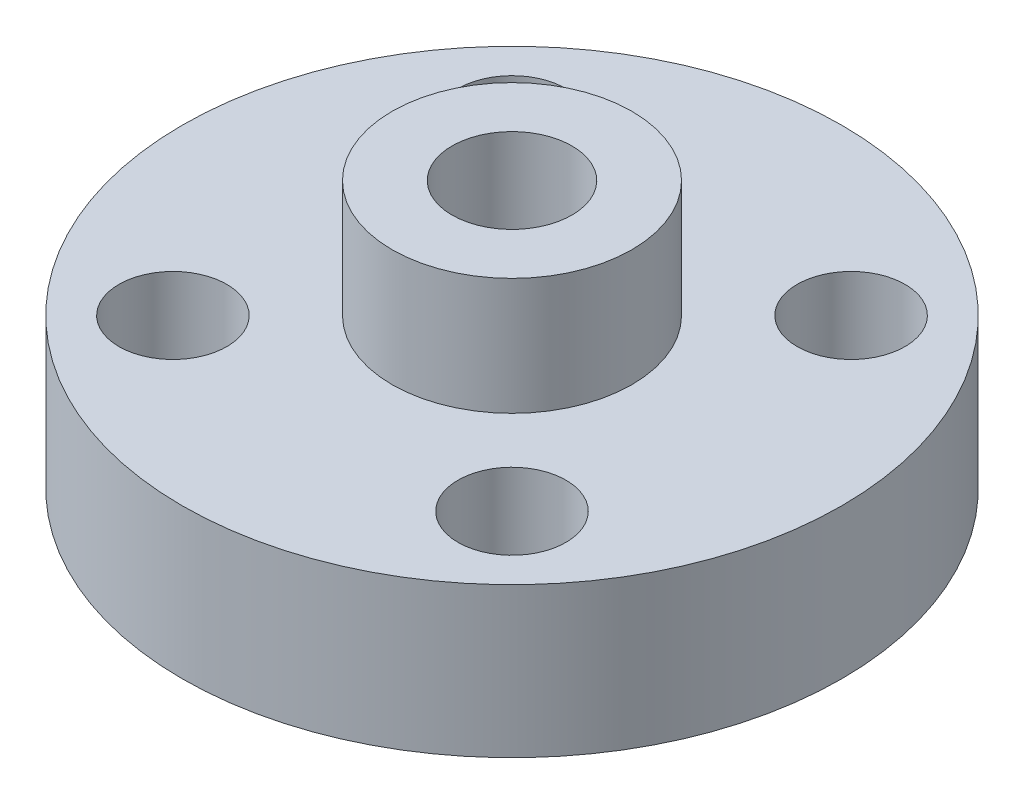
ISO-10303-21;
HEADER;
FILE_DESCRIPTION(('STEP AP214'),'2;1');
FILE_NAME('part.step','',(''),(''),'','','');
FILE_SCHEMA(('AUTOMOTIVE_DESIGN { 1 0 10303 214 1 1 1 1 }'));
ENDSEC;
DATA;
#1=APPLICATION_CONTEXT('core data for automotive mechanical design processes');
#2=APPLICATION_PROTOCOL_DEFINITION('international standard','automotive_design',2000,#1);
#3=PRODUCT_CONTEXT('',#1,'mechanical');
#4=PRODUCT('Part','Part','',(#3));
#5=PRODUCT_RELATED_PRODUCT_CATEGORY('part','',(#4));
#6=PRODUCT_DEFINITION_FORMATION('','',#4);
#7=PRODUCT_DEFINITION_CONTEXT('part definition',#1,'design');
#8=PRODUCT_DEFINITION('design','',#6,#7);
#9=PRODUCT_DEFINITION_SHAPE('','',#8);
#10=(LENGTH_UNIT() NAMED_UNIT(*) SI_UNIT(.MILLI.,.METRE.));
#11=(NAMED_UNIT(*) PLANE_ANGLE_UNIT() SI_UNIT($,.RADIAN.));
#12=(NAMED_UNIT(*) SI_UNIT($,.STERADIAN.) SOLID_ANGLE_UNIT());
#13=UNCERTAINTY_MEASURE_WITH_UNIT(LENGTH_MEASURE(1.E-05),#10,'distance_accuracy_value','');
#14=(GEOMETRIC_REPRESENTATION_CONTEXT(3) GLOBAL_UNCERTAINTY_ASSIGNED_CONTEXT((#13)) GLOBAL_UNIT_ASSIGNED_CONTEXT((#10,
#11,#12)) REPRESENTATION_CONTEXT('',''));
#15=CARTESIAN_POINT('',(0.,0.,0.));
#16=DIRECTION('',(0.,0.,1.));
#17=DIRECTION('',(1.,0.,0.));
#18=AXIS2_PLACEMENT_3D('',#15,#16,#17);
#19=CARTESIAN_POINT('',(0.,5.,0.));
#20=DIRECTION('',(0.,1.,0.));
#21=DIRECTION('',(0.,0.,1.));
#22=AXIS2_PLACEMENT_3D('',#19,#20,#21);
#23=PLANE('',#22);
#24=CARTESIAN_POINT('',(5.65685424949229,5.,5.65685424949247));
#25=DIRECTION('',(0.,1.,0.));
#26=DIRECTION('',(0.,0.,1.));
#27=AXIS2_PLACEMENT_3D('',#24,#25,#26);
#28=CIRCLE('',#27,1.8);
#29=CARTESIAN_POINT('',(5.65685424949229,5.,7.45685424949247));
#30=VERTEX_POINT('',#29);
#31=EDGE_CURVE('E77',#30,#30,#28,.T.);
#32=ORIENTED_EDGE('',*,*,#31,.F.);
#33=EDGE_LOOP('',(#32));
#34=FACE_BOUND('',#33,.T.);
#35=CARTESIAN_POINT('',(-5.65685424949229,5.,-5.65685424949247));
#36=DIRECTION('',(0.,1.,0.));
#37=DIRECTION('',(0.,0.,1.));
#38=AXIS2_PLACEMENT_3D('',#35,#36,#37);
#39=CIRCLE('',#38,1.8);
#40=CARTESIAN_POINT('',(-5.65685424949229,5.,-3.85685424949247));
#41=VERTEX_POINT('',#40);
#42=EDGE_CURVE('E71',#41,#41,#39,.T.);
#43=ORIENTED_EDGE('',*,*,#42,.F.);
#44=EDGE_LOOP('',(#43));
#45=FACE_BOUND('',#44,.T.);
#46=CARTESIAN_POINT('',(-5.65685424949237,5.,5.65685424949239));
#47=DIRECTION('',(0.,1.,0.));
#48=DIRECTION('',(0.,0.,1.));
#49=AXIS2_PLACEMENT_3D('',#46,#47,#48);
#50=CIRCLE('',#49,1.8);
#51=CARTESIAN_POINT('',(-5.65685424949237,5.,7.45685424949239));
#52=VERTEX_POINT('',#51);
#53=EDGE_CURVE('E65',#52,#52,#50,.T.);
#54=ORIENTED_EDGE('',*,*,#53,.F.);
#55=EDGE_LOOP('',(#54));
#56=FACE_BOUND('',#55,.T.);
#57=CARTESIAN_POINT('',(5.65685424949237,5.,-5.65685424949239));
#58=DIRECTION('',(0.,1.,0.));
#59=DIRECTION('',(0.,0.,1.));
#60=AXIS2_PLACEMENT_3D('',#57,#58,#59);
#61=CIRCLE('',#60,1.8);
#62=CARTESIAN_POINT('',(5.65685424949237,5.,-3.85685424949239));
#63=VERTEX_POINT('',#62);
#64=EDGE_CURVE('E59',#63,#63,#61,.T.);
#65=ORIENTED_EDGE('',*,*,#64,.F.);
#66=EDGE_LOOP('',(#65));
#67=FACE_BOUND('',#66,.T.);
#68=CARTESIAN_POINT('',(0.,5.,0.));
#69=DIRECTION('',(0.,1.,0.));
#70=DIRECTION('',(0.,0.,1.));
#71=AXIS2_PLACEMENT_3D('',#68,#69,#70);
#72=CIRCLE('',#71,11.);
#73=CARTESIAN_POINT('',(0.,5.,11.));
#74=VERTEX_POINT('',#73);
#75=EDGE_CURVE('E10',#74,#74,#72,.T.);
#76=ORIENTED_EDGE('',*,*,#75,.T.);
#77=EDGE_LOOP('',(#76));
#78=FACE_BOUND('',#77,.T.);
#79=CARTESIAN_POINT('',(0.,5.,0.));
#80=DIRECTION('',(0.,1.,0.));
#81=DIRECTION('',(0.,0.,1.));
#82=AXIS2_PLACEMENT_3D('',#79,#80,#81);
#83=CIRCLE('',#82,4.);
#84=CARTESIAN_POINT('',(0.,5.,4.));
#85=VERTEX_POINT('',#84);
#86=EDGE_CURVE('E53',#85,#85,#83,.T.);
#87=ORIENTED_EDGE('',*,*,#86,.F.);
#88=EDGE_LOOP('',(#87));
#89=FACE_BOUND('',#88,.T.);
#90=ADVANCED_FACE('F33',(#34,#45,#56,#67,#78,#89),#23,.T.);
#91=CARTESIAN_POINT('',(0.,5.,0.));
#92=DIRECTION('',(0.,-1.,0.));
#93=DIRECTION('',(0.,0.,-1.));
#94=AXIS2_PLACEMENT_3D('',#91,#92,#93);
#95=CYLINDRICAL_SURFACE('',#94,11.);
#96=CARTESIAN_POINT('',(0.,3.75,-11.));
#97=CARTESIAN_POINT('',(-0.069971060246352,3.74999699818814,-10.999999098796));
#98=CARTESIAN_POINT('',(-0.139987069063114,3.74410506509641,-10.9993252987046));
#99=CARTESIAN_POINT('',(-0.27807424350527,3.7206920371657,-10.996702178266));
#100=CARTESIAN_POINT('',(-0.346143242753095,3.7031584768452,-10.9947514907003));
#101=CARTESIAN_POINT('',(-0.478317045301572,3.65698245914168,-10.9897945640633));
#102=CARTESIAN_POINT('',(-0.542424355017518,3.62834711062706,-10.9867890005829));
#103=CARTESIAN_POINT('',(-0.664910051163533,3.56079510299002,-10.9800574647103));
#104=CARTESIAN_POINT('',(-0.723289492682512,3.52188034225789,-10.9763316253718));
#105=CARTESIAN_POINT('',(-0.832943192201771,3.43468294825341,-10.968557071608));
#106=CARTESIAN_POINT('',(-0.884187415913993,3.38636265432368,-10.9645070990459));
#107=CARTESIAN_POINT('',(-0.9778576114592,3.28180649659008,-10.9565510031881));
#108=CARTESIAN_POINT('',(-1.0202831544839,3.22557024809588,-10.9526448868951));
#109=CARTESIAN_POINT('',(-1.09522113283393,3.10658651677425,-10.9454062056308));
#110=CARTESIAN_POINT('',(-1.12770585724159,3.04382147448482,-10.9420752550327));
#111=CARTESIAN_POINT('',(-1.18166312999782,2.91368303245055,-10.9363802408844));
#112=CARTESIAN_POINT('',(-1.20313602534931,2.84630977799478,-10.9340161468672));
#113=CARTESIAN_POINT('',(-1.23436981435034,2.70917683280815,-10.9305342775891));
#114=CARTESIAN_POINT('',(-1.24418104088519,2.63942874432143,-10.9294111476981));
#115=CARTESIAN_POINT('',(-1.25196865940665,2.49926759216056,-10.928521890078));
#116=CARTESIAN_POINT('',(-1.24994544765987,2.42885455083064,-10.9287557169125));
#117=CARTESIAN_POINT('',(-1.23416301698983,2.2897111909642,-10.9305490559729));
#118=CARTESIAN_POINT('',(-1.22045900541516,2.22097451875746,-10.9321023319257));
#119=CARTESIAN_POINT('',(-1.18179000539199,2.08678297309618,-10.9363498240334));
#120=CARTESIAN_POINT('',(-1.15682482519952,2.02132815554287,-10.9390440596154));
#121=CARTESIAN_POINT('',(-1.09628205008229,1.89538543961468,-10.9452770263127));
#122=CARTESIAN_POINT('',(-1.0606802226634,1.83490928933373,-10.9488176820281));
#123=CARTESIAN_POINT('',(-0.97989212909765,1.72076925155199,-10.9563429994385));
#124=CARTESIAN_POINT('',(-0.934705500466707,1.66710562181413,-10.9603276779232));
#125=CARTESIAN_POINT('',(-0.83572337613361,1.56779331897667,-10.9683198318057));
#126=CARTESIAN_POINT('',(-0.781880249551105,1.52219210498768,-10.9723273076041));
#127=CARTESIAN_POINT('',(-0.667278205581041,1.44066779872062,-10.9798921650149));
#128=CARTESIAN_POINT('',(-0.606519276591015,1.40474472267966,-10.9834495458722));
#129=CARTESIAN_POINT('',(-0.479775541657342,1.34359731749806,-10.9897150774974));
#130=CARTESIAN_POINT('',(-0.413789421907936,1.318375688256,-10.9924230139116));
#131=CARTESIAN_POINT('',(-0.278481205096859,1.27938340396215,-10.9966825017733));
#132=CARTESIAN_POINT('',(-0.209159237088376,1.26561230630247,-10.9982340979176));
#133=CARTESIAN_POINT('',(-0.0695577812372831,1.24997287847912,-11.0000003081264));
#134=CARTESIAN_POINT('',(0.000714287189984298,1.24803911714425,-11.0002222716223));
#135=CARTESIAN_POINT('',(0.140581487877393,1.25595697581694,-10.9993239851522));
#136=CARTESIAN_POINT('',(0.210176631981749,1.26580838924277,-10.9982037587135));
#137=CARTESIAN_POINT('',(0.346523396585519,1.29696262846704,-10.994751592849));
#138=CARTESIAN_POINT('',(0.413282173840756,1.31823452614039,-10.9924229265985));
#139=CARTESIAN_POINT('',(0.542284372808938,1.37159392721105,-10.9868148348929));
#140=CARTESIAN_POINT('',(0.604527665792278,1.40368173880652,-10.9835353823457));
#141=CARTESIAN_POINT('',(0.72302600604694,1.47792232596807,-10.9763735736619));
#142=CARTESIAN_POINT('',(0.77925417992158,1.52011774715062,-10.9724886880503));
#143=CARTESIAN_POINT('',(0.883853426159775,1.61331505860913,-10.9645592695384));
#144=CARTESIAN_POINT('',(0.932224242281437,1.66431723597664,-10.9605147314369));
#145=CARTESIAN_POINT('',(1.01996547066726,1.77396722356543,-10.9526994422005));
#146=CARTESIAN_POINT('',(1.05929271449872,1.83264968850057,-10.9489300605485));
#147=CARTESIAN_POINT('',(1.12753292733449,1.95582498686534,-10.942113624429));
#148=CARTESIAN_POINT('',(1.1564460738557,2.0203177212307,-10.9390665576492));
#149=CARTESIAN_POINT('',(1.20296631338929,2.15313935058659,-10.9340487479586));
#150=CARTESIAN_POINT('',(1.22059839191765,2.22145940091596,-10.9320756279092));
#151=CARTESIAN_POINT('',(1.24413675347569,2.36011418608627,-10.9294220488897));
#152=CARTESIAN_POINT('',(1.25004348037983,2.43044884456001,-10.9287415409866));
#153=CARTESIAN_POINT('',(1.24995628412517,2.57070705786577,-10.9287514804399));
#154=CARTESIAN_POINT('',(1.2440301726015,2.64063066519323,-10.9294341158956));
#155=CARTESIAN_POINT('',(1.22058843708507,2.77848162141657,-10.9320766991578));
#156=CARTESIAN_POINT('',(1.20307280564944,2.84640896903041,-10.9340366477846));
#157=CARTESIAN_POINT('',(1.15696926667395,2.9783342740526,-10.9390107260672));
#158=CARTESIAN_POINT('',(1.12838402190138,3.0423331721536,-10.9420246021864));
#159=CARTESIAN_POINT('',(1.06095945000961,3.16463624005349,-10.9487674156768));
#160=CARTESIAN_POINT('',(1.0221200832636,3.22294038784396,-10.9524963558113));
#161=CARTESIAN_POINT('',(0.935036488100244,3.33254612900023,-10.9602747641055));
#162=CARTESIAN_POINT('',(0.886741677283601,3.3838074186029,-10.96432588332));
#163=CARTESIAN_POINT('',(0.782221793226736,3.47752568809066,-10.972277338952));
#164=CARTESIAN_POINT('',(0.725994839471986,3.51998057428255,-10.9761776393339));
#165=CARTESIAN_POINT('',(0.607005915440281,3.59499201372946,-10.9834013412845));
#166=CARTESIAN_POINT('',(0.54422378573775,3.62751674875123,-10.9867228740683));
#167=CARTESIAN_POINT('',(0.414088724760015,3.68151706433772,-10.9923953332668));
#168=CARTESIAN_POINT('',(0.346740944451992,3.70300486944508,-10.9947473329669));
#169=CARTESIAN_POINT('',(0.232523699684409,3.7290739614261,-10.9976371163841));
#170=CARTESIAN_POINT('',(0.18637950484338,3.73691021850484,-10.9985189706332));
#171=CARTESIAN_POINT('',(0.0934968952111788,3.74737422589619,-10.9997007118951));
#172=CARTESIAN_POINT('',(0.0467584838174206,3.75000200597462,-11.0000006022337));
#173=CARTESIAN_POINT('',(0.,3.75,-11.));
#174=B_SPLINE_CURVE_WITH_KNOTS('',3,(#96,#97,#98,#99,#100,#101,#102,#103,#104,#105,#106,#107,
#108,#109,#110,#111,#112,#113,#114,#115,#116,#117,#118,#119,#120,#121,#122,#123,#124,#125,#126,
#127,#128,#129,#130,#131,#132,#133,#134,#135,#136,#137,#138,#139,#140,#141,#142,#143,#144,#145,
#146,#147,#148,#149,#150,#151,#152,#153,#154,#155,#156,#157,#158,#159,#160,#161,#162,#163,#164,
#165,#166,#167,#168,#169,#170,#171,#172,#173),.UNSPECIFIED.,.T.,.F.,(4,2,2,2,2,2,2,2,2,2,2,2,2,
2,2,2,2,2,2,2,2,2,2,2,2,2,2,2,2,2,2,2,2,2,2,2,2,2,4),(0.,0.209742411074567,0.419709770574088,
0.629542902006037,0.839337308750923,1.04998970573655,1.26065234329855,1.47189698188367,
1.68313496335365,1.89345787180112,2.10377373779623,2.31310105799441,2.52243194254448,
2.73224341085967,2.94206281537296,3.15307892807649,3.36409539480162,3.57516506786321,
3.78622658187585,3.99612038686368,4.20601051268755,4.41533507552064,4.62466560353621,
4.83489538837651,5.04513202779438,5.25635228791534,5.4675689474421,5.67831616606274,
5.88905540649307,6.09859040856626,6.30812554520447,6.51761030997687,6.72709588430993,
6.9377343421937,7.14842282141904,7.35977947100788,7.57090151365798,7.71106364850652,
7.85122498234265),.UNSPECIFIED.);
#175=CARTESIAN_POINT('',(0.,3.75,-11.));
#176=VERTEX_POINT('',#175);
#177=EDGE_CURVE('E86',#176,#176,#174,.T.);
#178=ORIENTED_EDGE('',*,*,#177,.T.);
#179=EDGE_LOOP('',(#178));
#180=FACE_BOUND('',#179,.T.);
#181=ORIENTED_EDGE('',*,*,#75,.F.);
#182=EDGE_LOOP('',(#181));
#183=FACE_BOUND('',#182,.T.);
#184=CARTESIAN_POINT('',(0.,0.,0.));
#185=DIRECTION('',(0.,1.,0.));
#186=DIRECTION('',(0.,0.,1.));
#187=AXIS2_PLACEMENT_3D('',#184,#185,#186);
#188=CIRCLE('',#187,11.);
#189=CARTESIAN_POINT('',(0.,0.,11.));
#190=VERTEX_POINT('',#189);
#191=EDGE_CURVE('E46',#190,#190,#188,.T.);
#192=ORIENTED_EDGE('',*,*,#191,.T.);
#193=EDGE_LOOP('',(#192));
#194=FACE_BOUND('',#193,.T.);
#195=ADVANCED_FACE('F35',(#180,#183,#194),#95,.T.);
#196=CARTESIAN_POINT('',(0.,0.,0.));
#197=DIRECTION('',(0.,1.,0.));
#198=DIRECTION('',(0.,0.,1.));
#199=AXIS2_PLACEMENT_3D('',#196,#197,#198);
#200=PLANE('',#199);
#201=CARTESIAN_POINT('',(0.,0.,0.));
#202=DIRECTION('',(0.,1.,0.));
#203=DIRECTION('',(0.,0.,1.));
#204=AXIS2_PLACEMENT_3D('',#201,#202,#203);
#205=CIRCLE('',#204,2.);
#206=CARTESIAN_POINT('',(0.,0.,2.));
#207=VERTEX_POINT('',#206);
#208=EDGE_CURVE('E80',#207,#207,#205,.T.);
#209=ORIENTED_EDGE('',*,*,#208,.T.);
#210=EDGE_LOOP('',(#209));
#211=FACE_BOUND('',#210,.T.);
#212=CARTESIAN_POINT('',(5.65685424949229,0.,5.65685424949247));
#213=DIRECTION('',(0.,1.,0.));
#214=DIRECTION('',(0.,0.,1.));
#215=AXIS2_PLACEMENT_3D('',#212,#213,#214);
#216=CIRCLE('',#215,1.8);
#217=CARTESIAN_POINT('',(5.65685424949229,0.,7.45685424949247));
#218=VERTEX_POINT('',#217);
#219=EDGE_CURVE('E74',#218,#218,#216,.T.);
#220=ORIENTED_EDGE('',*,*,#219,.T.);
#221=EDGE_LOOP('',(#220));
#222=FACE_BOUND('',#221,.T.);
#223=CARTESIAN_POINT('',(-5.65685424949229,0.,-5.65685424949247));
#224=DIRECTION('',(0.,1.,0.));
#225=DIRECTION('',(0.,0.,1.));
#226=AXIS2_PLACEMENT_3D('',#223,#224,#225);
#227=CIRCLE('',#226,1.8);
#228=CARTESIAN_POINT('',(-5.65685424949229,0.,-3.85685424949247));
#229=VERTEX_POINT('',#228);
#230=EDGE_CURVE('E68',#229,#229,#227,.T.);
#231=ORIENTED_EDGE('',*,*,#230,.T.);
#232=EDGE_LOOP('',(#231));
#233=FACE_BOUND('',#232,.T.);
#234=CARTESIAN_POINT('',(-5.65685424949237,0.,5.65685424949239));
#235=DIRECTION('',(0.,1.,0.));
#236=DIRECTION('',(0.,0.,1.));
#237=AXIS2_PLACEMENT_3D('',#234,#235,#236);
#238=CIRCLE('',#237,1.8);
#239=CARTESIAN_POINT('',(-5.65685424949237,0.,7.45685424949239));
#240=VERTEX_POINT('',#239);
#241=EDGE_CURVE('E62',#240,#240,#238,.T.);
#242=ORIENTED_EDGE('',*,*,#241,.T.);
#243=EDGE_LOOP('',(#242));
#244=FACE_BOUND('',#243,.T.);
#245=CARTESIAN_POINT('',(5.65685424949237,0.,-5.65685424949239));
#246=DIRECTION('',(0.,1.,0.));
#247=DIRECTION('',(0.,0.,1.));
#248=AXIS2_PLACEMENT_3D('',#245,#246,#247);
#249=CIRCLE('',#248,1.8);
#250=CARTESIAN_POINT('',(5.65685424949237,0.,-3.85685424949239));
#251=VERTEX_POINT('',#250);
#252=EDGE_CURVE('E56',#251,#251,#249,.T.);
#253=ORIENTED_EDGE('',*,*,#252,.T.);
#254=EDGE_LOOP('',(#253));
#255=FACE_BOUND('',#254,.T.);
#256=ORIENTED_EDGE('',*,*,#191,.F.);
#257=EDGE_LOOP('',(#256));
#258=FACE_BOUND('',#257,.T.);
#259=ADVANCED_FACE('F125',(#211,#222,#233,#244,#255,#258),#200,.F.);
#260=CARTESIAN_POINT('',(0.,8.9,0.));
#261=DIRECTION('',(0.,-1.,0.));
#262=DIRECTION('',(0.,0.,-1.));
#263=AXIS2_PLACEMENT_3D('',#260,#261,#262);
#264=CYLINDRICAL_SURFACE('',#263,4.);
#265=CARTESIAN_POINT('',(0.,8.9,0.));
#266=DIRECTION('',(0.,1.,0.));
#267=DIRECTION('',(0.,0.,1.));
#268=AXIS2_PLACEMENT_3D('',#265,#266,#267);
#269=CIRCLE('',#268,4.);
#270=CARTESIAN_POINT('',(0.,8.9,4.));
#271=VERTEX_POINT('',#270);
#272=EDGE_CURVE('E51',#271,#271,#269,.T.);
#273=ORIENTED_EDGE('',*,*,#272,.F.);
#274=EDGE_LOOP('',(#273));
#275=FACE_BOUND('',#274,.T.);
#276=ORIENTED_EDGE('',*,*,#86,.T.);
#277=EDGE_LOOP('',(#276));
#278=FACE_BOUND('',#277,.T.);
#279=ADVANCED_FACE('F121',(#275,#278),#264,.T.);
#280=CARTESIAN_POINT('',(0.,8.9,0.));
#281=DIRECTION('',(0.,1.,0.));
#282=DIRECTION('',(0.,0.,1.));
#283=AXIS2_PLACEMENT_3D('',#280,#281,#282);
#284=PLANE('',#283);
#285=CARTESIAN_POINT('',(0.,8.9,0.));
#286=DIRECTION('',(0.,1.,0.));
#287=DIRECTION('',(0.,0.,1.));
#288=AXIS2_PLACEMENT_3D('',#285,#286,#287);
#289=CIRCLE('',#288,2.);
#290=CARTESIAN_POINT('',(0.,8.9,2.));
#291=VERTEX_POINT('',#290);
#292=EDGE_CURVE('E83',#291,#291,#289,.T.);
#293=ORIENTED_EDGE('',*,*,#292,.F.);
#294=EDGE_LOOP('',(#293));
#295=FACE_BOUND('',#294,.T.);
#296=ORIENTED_EDGE('',*,*,#272,.T.);
#297=EDGE_LOOP('',(#296));
#298=FACE_BOUND('',#297,.T.);
#299=ADVANCED_FACE('F117',(#295,#298),#284,.T.);
#300=CARTESIAN_POINT('',(5.65685424949237,0.,-5.65685424949239));
#301=DIRECTION('',(0.,1.,0.));
#302=DIRECTION('',(0.,0.,1.));
#303=AXIS2_PLACEMENT_3D('',#300,#301,#302);
#304=CYLINDRICAL_SURFACE('',#303,1.8);
#305=ORIENTED_EDGE('',*,*,#252,.F.);
#306=EDGE_LOOP('',(#305));
#307=FACE_BOUND('',#306,.T.);
#308=ORIENTED_EDGE('',*,*,#64,.T.);
#309=EDGE_LOOP('',(#308));
#310=FACE_BOUND('',#309,.T.);
#311=ADVANCED_FACE('F113',(#307,#310),#304,.F.);
#312=CARTESIAN_POINT('',(-5.65685424949237,0.,5.65685424949239));
#313=DIRECTION('',(0.,1.,0.));
#314=DIRECTION('',(0.,0.,1.));
#315=AXIS2_PLACEMENT_3D('',#312,#313,#314);
#316=CYLINDRICAL_SURFACE('',#315,1.8);
#317=ORIENTED_EDGE('',*,*,#241,.F.);
#318=EDGE_LOOP('',(#317));
#319=FACE_BOUND('',#318,.T.);
#320=ORIENTED_EDGE('',*,*,#53,.T.);
#321=EDGE_LOOP('',(#320));
#322=FACE_BOUND('',#321,.T.);
#323=ADVANCED_FACE('F109',(#319,#322),#316,.F.);
#324=CARTESIAN_POINT('',(-5.65685424949229,0.,-5.65685424949247));
#325=DIRECTION('',(0.,1.,0.));
#326=DIRECTION('',(0.,0.,1.));
#327=AXIS2_PLACEMENT_3D('',#324,#325,#326);
#328=CYLINDRICAL_SURFACE('',#327,1.8);
#329=ORIENTED_EDGE('',*,*,#230,.F.);
#330=EDGE_LOOP('',(#329));
#331=FACE_BOUND('',#330,.T.);
#332=ORIENTED_EDGE('',*,*,#42,.T.);
#333=EDGE_LOOP('',(#332));
#334=FACE_BOUND('',#333,.T.);
#335=ADVANCED_FACE('F105',(#331,#334),#328,.F.);
#336=CARTESIAN_POINT('',(5.65685424949229,0.,5.65685424949247));
#337=DIRECTION('',(0.,1.,0.));
#338=DIRECTION('',(0.,0.,1.));
#339=AXIS2_PLACEMENT_3D('',#336,#337,#338);
#340=CYLINDRICAL_SURFACE('',#339,1.8);
#341=ORIENTED_EDGE('',*,*,#219,.F.);
#342=EDGE_LOOP('',(#341));
#343=FACE_BOUND('',#342,.T.);
#344=ORIENTED_EDGE('',*,*,#31,.T.);
#345=EDGE_LOOP('',(#344));
#346=FACE_BOUND('',#345,.T.);
#347=ADVANCED_FACE('F101',(#343,#346),#340,.F.);
#348=CARTESIAN_POINT('',(0.,0.,0.));
#349=DIRECTION('',(0.,1.,0.));
#350=DIRECTION('',(0.,0.,1.));
#351=AXIS2_PLACEMENT_3D('',#348,#349,#350);
#352=CYLINDRICAL_SURFACE('',#351,2.);
#353=CARTESIAN_POINT('',(1.25,2.5,-1.5612494995996));
#354=CARTESIAN_POINT('',(1.24999462210485,2.43787971819707,-1.56125800072558));
#355=CARTESIAN_POINT('',(1.24532693849666,2.37566216462974,-1.56502642708837));
#356=CARTESIAN_POINT('',(1.22698950832934,2.25332367992062,-1.57943717205478));
#357=CARTESIAN_POINT('',(1.21329530430551,2.19320891363476,-1.59009816464115));
#358=CARTESIAN_POINT('',(1.17788073911871,2.07721767730116,-1.61650085329041));
#359=CARTESIAN_POINT('',(1.15622993332784,2.02130939131819,-1.63219837418033));
#360=CARTESIAN_POINT('',(1.10571945561924,1.91399113836185,-1.66682950714432));
#361=CARTESIAN_POINT('',(1.07685958706091,1.86258129414349,-1.68576320748676));
#362=CARTESIAN_POINT('',(1.00823937928364,1.75813484552302,-1.72779611374711));
#363=CARTESIAN_POINT('',(0.967536093692502,1.70580525916741,-1.75111338227346));
#364=CARTESIAN_POINT('',(0.878308664496878,1.60811730085503,-1.79752820854877));
#365=CARTESIAN_POINT('',(0.829777781297412,1.56276500271608,-1.82062555863329));
#366=CARTESIAN_POINT('',(0.71918666525849,1.47489641485188,-1.86729453891009));
#367=CARTESIAN_POINT('',(0.656200568910555,1.43338233189569,-1.8905872224145));
#368=CARTESIAN_POINT('',(0.522404070837314,1.36187479523684,-1.9318323169914));
#369=CARTESIAN_POINT('',(0.45160150647824,1.33186993424875,-1.94979001179838));
#370=CARTESIAN_POINT('',(0.311776878362017,1.28751768939294,-1.97669841318201));
#371=CARTESIAN_POINT('',(0.24330563604724,1.27188858360306,-1.98637922422038));
#372=CARTESIAN_POINT('',(0.104105100662262,1.2523679303566,-1.99850544379202));
#373=CARTESIAN_POINT('',(0.0333782605640261,1.24846404387945,-2.00095845843657));
#374=CARTESIAN_POINT('',(-0.0980658284213408,1.25235568927761,-1.99852909107528));
#375=CARTESIAN_POINT('',(-0.158852523273786,1.2586513763009,-1.99458699811902));
#376=CARTESIAN_POINT('',(-0.27830664590367,1.27986698436332,-1.98145272261225));
#377=CARTESIAN_POINT('',(-0.336973913146974,1.29478755723752,-1.97226014325117));
#378=CARTESIAN_POINT('',(-0.450889117077073,1.33260377509712,-1.94938133614675));
#379=CARTESIAN_POINT('',(-0.506127875493233,1.35551982404859,-1.93568361673912));
#380=CARTESIAN_POINT('',(-0.612019220469382,1.40846875525999,-1.90485632889331));
#381=CARTESIAN_POINT('',(-0.662670758560001,1.4385032588906,-1.88772597874226));
#382=CARTESIAN_POINT('',(-0.764713515567041,1.50902816532937,-1.84893224750793));
#383=CARTESIAN_POINT('',(-0.81541234491895,1.55035462674233,-1.82697004307144));
#384=CARTESIAN_POINT('',(-0.909598595905498,1.64013238022337,-1.78195462752237));
#385=CARTESIAN_POINT('',(-0.953075338789632,1.68859402644655,-1.75889986449171));
#386=CARTESIAN_POINT('',(-1.03735445892932,1.7987056229061,-1.71071442112196));
#387=CARTESIAN_POINT('',(-1.07706615479946,1.8612513808503,-1.68570581533195));
#388=CARTESIAN_POINT('',(-1.14526153203309,1.99364611977342,-1.640141390954));
#389=CARTESIAN_POINT('',(-1.17376589603358,2.06348134395541,-1.6195774019168));
#390=CARTESIAN_POINT('',(-1.21218566853166,2.18976940288787,-1.5909187656712));
#391=CARTESIAN_POINT('',(-1.22501841721721,2.24491096263767,-1.58096704305272));
#392=CARTESIAN_POINT('',(-1.24310168537523,2.35711518874893,-1.56679138875765));
#393=CARTESIAN_POINT('',(-1.24836256353275,2.4141751210399,-1.56255963237428));
#394=CARTESIAN_POINT('',(-1.25098535954508,2.52872868054027,-1.56046133530164));
#395=CARTESIAN_POINT('',(-1.24832917576576,2.58622300136582,-1.56260938140435));
#396=CARTESIAN_POINT('',(-1.23525733555987,2.6997805810316,-1.57296042862705));
#397=CARTESIAN_POINT('',(-1.22483525320262,2.75584261496292,-1.58116844404657));
#398=CARTESIAN_POINT('',(-1.1970493572483,2.8642183838658,-1.60230060601957));
#399=CARTESIAN_POINT('',(-1.17980280626788,2.91657867333151,-1.61514477937171));
#400=CARTESIAN_POINT('',(-1.13902451938523,3.01778733455698,-1.64415573440841));
#401=CARTESIAN_POINT('',(-1.11549055271421,3.0666344520245,-1.66032369489908));
#402=CARTESIAN_POINT('',(-1.05765376772319,3.16930603917703,-1.69787203988937));
#403=CARTESIAN_POINT('',(-1.02215373814221,3.22230754124933,-1.7196587573829));
#404=CARTESIAN_POINT('',(-0.943690263224862,3.32218505243915,-1.76393958000711));
#405=CARTESIAN_POINT('',(-0.9007190744966,3.36905461697796,-1.78643439903354));
#406=CARTESIAN_POINT('',(-0.800380659499193,3.46298324624316,-1.83383164018972));
#407=CARTESIAN_POINT('',(-0.741809949714163,3.50886855700768,-1.85854204787597));
#408=CARTESIAN_POINT('',(-0.616299987869577,3.59006865187586,-1.90384248964999));
#409=CARTESIAN_POINT('',(-0.549364678748661,3.62538838997364,-1.92443445329133));
#410=CARTESIAN_POINT('',(-0.412925900636599,3.68199499120264,-1.95809255957561));
#411=CARTESIAN_POINT('',(-0.343814822544518,3.70399420647076,-1.9715348458918));
#412=CARTESIAN_POINT('',(-0.201860998884746,3.73572666868109,-1.9910701008804));
#413=CARTESIAN_POINT('',(-0.129023563238366,3.74547688976111,-1.99717323933003));
#414=CARTESIAN_POINT('',(0.00659907199681289,3.75154652003878,-2.00096685748559));
#415=CARTESIAN_POINT('',(0.0692812975954747,3.74963577678699,-1.99976600623617));
#416=CARTESIAN_POINT('',(0.193279811091726,3.73653832502566,-1.99160739958772));
#417=CARTESIAN_POINT('',(0.254596160840743,3.72535203742423,-1.98464990541518));
#418=CARTESIAN_POINT('',(0.372043294685526,3.69483952512341,-1.9659610468898));
#419=CARTESIAN_POINT('',(0.428280180678309,3.6758091601268,-1.95440367471701));
#420=CARTESIAN_POINT('',(0.536714369111315,3.63044007183593,-1.92744968677265));
#421=CARTESIAN_POINT('',(0.58891098811824,3.60410011552441,-1.91205242331406));
#422=CARTESIAN_POINT('',(0.693656737470666,3.5418394210088,-1.87675342239825));
#423=CARTESIAN_POINT('',(0.745680127162211,3.50520801868102,-1.85655002466956));
#424=CARTESIAN_POINT('',(0.843216608355414,3.4249233696673,-1.81433640456238));
#425=CARTESIAN_POINT('',(0.88872224305523,3.38126219975406,-1.7923241573062));
#426=CARTESIAN_POINT('',(0.978723601300805,3.28088373769673,-1.74500415099525));
#427=CARTESIAN_POINT('',(1.02212829873816,3.22319165482308,-1.71967871446314));
#428=CARTESIAN_POINT('',(1.09877325005744,3.10035533398988,-1.67174821497037));
#429=CARTESIAN_POINT('',(1.132019125571,3.0352152450924,-1.64914165167051));
#430=CARTESIAN_POINT('',(1.18099110923231,2.91359723207033,-1.61429776080214));
#431=CARTESIAN_POINT('',(1.19896216276381,2.85836431912064,-1.60087340349652));
#432=CARTESIAN_POINT('',(1.22712822180408,2.74503072204281,-1.57939158437939));
#433=CARTESIAN_POINT('',(1.23734784245404,2.68693974497586,-1.57131714400176));
#434=CARTESIAN_POINT('',(1.24559906183097,2.60696947613715,-1.56476456389394));
#435=CARTESIAN_POINT('',(1.24724671259581,2.58563585448301,-1.56345069546827));
#436=CARTESIAN_POINT('',(1.24944824734288,2.54287203347851,-1.56169158695047));
#437=CARTESIAN_POINT('',(1.25000185626673,2.52144181119832,-1.56124656529967));
#438=CARTESIAN_POINT('',(1.25,2.5,-1.5612494995996));
#439=B_SPLINE_CURVE_WITH_KNOTS('',3,(#353,#354,#355,#356,#357,#358,#359,#360,#361,#362,#363,
#364,#365,#366,#367,#368,#369,#370,#371,#372,#373,#374,#375,#376,#377,#378,#379,#380,#381,#382,
#383,#384,#385,#386,#387,#388,#389,#390,#391,#392,#393,#394,#395,#396,#397,#398,#399,#400,#401,
#402,#403,#404,#405,#406,#407,#408,#409,#410,#411,#412,#413,#414,#415,#416,#417,#418,#419,#420,
#421,#422,#423,#424,#425,#426,#427,#428,#429,#430,#431,#432,#433,#434,#435,#436,#437,#438),
.UNSPECIFIED.,.T.,.F.,(4,2,2,2,2,2,2,2,2,2,2,2,2,2,2,2,2,2,2,2,2,2,2,2,2,2,2,2,2,2,2,2,2,2,2,2,
2,2,2,2,2,2,4),(0.,0.186262444012015,0.373031654397096,0.558205556130402,0.743384509377751,
0.953406207440075,1.16360970997911,1.39917236034457,1.6345009273926,1.84590412815398,
2.05708478092387,2.23992319583511,2.42277543076414,2.60609774825956,2.78946186128171,
2.99564504832107,3.20213044016186,3.43558067920821,3.66859805095277,3.84032775480268,
4.01182230007289,4.18370925240739,4.35573859160081,4.52493212343599,4.69418576487136,
4.89566333610129,5.09735098485254,5.33136598660889,5.56527109061626,5.78520080494549,
6.00482541258961,6.19203601525124,6.37923812308583,6.55994569114424,6.74068376037881,
6.94018144108745,7.13990556958868,7.36841817421249,7.59680409585386,7.77496902270412,
7.95256577963385,8.01684109069498,8.08113255947023),.UNSPECIFIED.);
#440=CARTESIAN_POINT('',(1.25,2.5,-1.5612494995996));
#441=VERTEX_POINT('',#440);
#442=EDGE_CURVE('E38',#441,#441,#439,.T.);
#443=ORIENTED_EDGE('',*,*,#442,.T.);
#444=EDGE_LOOP('',(#443));
#445=FACE_BOUND('',#444,.T.);
#446=ORIENTED_EDGE('',*,*,#208,.F.);
#447=EDGE_LOOP('',(#446));
#448=FACE_BOUND('',#447,.T.);
#449=ORIENTED_EDGE('',*,*,#292,.T.);
#450=EDGE_LOOP('',(#449));
#451=FACE_BOUND('',#450,.T.);
#452=ADVANCED_FACE('F95',(#445,#448,#451),#352,.F.);
#453=CARTESIAN_POINT('',(0.,2.5,-13.));
#454=DIRECTION('',(0.,0.,1.));
#455=DIRECTION('',(1.,0.,0.));
#456=AXIS2_PLACEMENT_3D('',#453,#454,#455);
#457=CYLINDRICAL_SURFACE('',#456,1.25);
#458=ORIENTED_EDGE('',*,*,#442,.F.);
#459=EDGE_LOOP('',(#458));
#460=FACE_BOUND('',#459,.T.);
#461=ORIENTED_EDGE('',*,*,#177,.F.);
#462=EDGE_LOOP('',(#461));
#463=FACE_BOUND('',#462,.T.);
#464=ADVANCED_FACE('F92',(#460,#463),#457,.F.);
#465=CLOSED_SHELL('',(#90,#195,#259,#279,#299,#311,#323,#335,#347,#452,#464));
#466=MANIFOLD_SOLID_BREP('B2',#465);
#467=ADVANCED_BREP_SHAPE_REPRESENTATION('',(#18,#466),#14);
#468=SHAPE_DEFINITION_REPRESENTATION(#9,#467);
ENDSEC;
END-ISO-10303-21;
